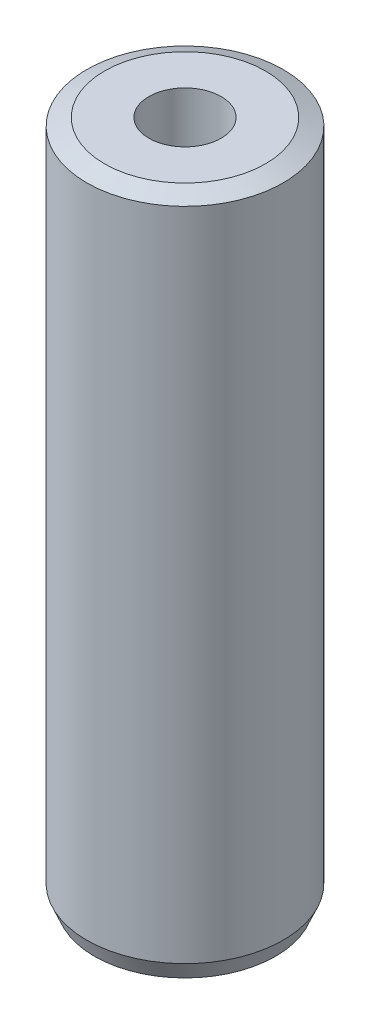
ISO-10303-21;
HEADER;
FILE_DESCRIPTION(('STEP AP214'),'2;1');
FILE_NAME('part.step','',(''),(''),'','','');
FILE_SCHEMA(('AUTOMOTIVE_DESIGN { 1 0 10303 214 1 1 1 1 }'));
ENDSEC;
DATA;
#1=APPLICATION_CONTEXT('core data for automotive mechanical design processes');
#2=APPLICATION_PROTOCOL_DEFINITION('international standard','automotive_design',2000,#1);
#3=PRODUCT_CONTEXT('',#1,'mechanical');
#4=PRODUCT('Part','Part','',(#3));
#5=PRODUCT_RELATED_PRODUCT_CATEGORY('part','',(#4));
#6=PRODUCT_DEFINITION_FORMATION('','',#4);
#7=PRODUCT_DEFINITION_CONTEXT('part definition',#1,'design');
#8=PRODUCT_DEFINITION('design','',#6,#7);
#9=PRODUCT_DEFINITION_SHAPE('','',#8);
#10=(LENGTH_UNIT() NAMED_UNIT(*) SI_UNIT(.MILLI.,.METRE.));
#11=(NAMED_UNIT(*) PLANE_ANGLE_UNIT() SI_UNIT($,.RADIAN.));
#12=(NAMED_UNIT(*) SI_UNIT($,.STERADIAN.) SOLID_ANGLE_UNIT());
#13=UNCERTAINTY_MEASURE_WITH_UNIT(LENGTH_MEASURE(1.E-05),#10,'distance_accuracy_value','');
#14=(GEOMETRIC_REPRESENTATION_CONTEXT(3) GLOBAL_UNCERTAINTY_ASSIGNED_CONTEXT((#13)) GLOBAL_UNIT_ASSIGNED_CONTEXT((#10,
#11,#12)) REPRESENTATION_CONTEXT('',''));
#15=CARTESIAN_POINT('',(0.,0.,0.));
#16=DIRECTION('',(0.,0.,1.));
#17=DIRECTION('',(1.,0.,0.));
#18=AXIS2_PLACEMENT_3D('',#15,#16,#17);
#19=CARTESIAN_POINT('',(0.,416.11274760037,0.));
#20=DIRECTION('',(0.,-1.,0.));
#21=DIRECTION('',(0.,0.,-1.));
#22=AXIS2_PLACEMENT_3D('',#19,#20,#21);
#23=CYLINDRICAL_SURFACE('',#22,60.);
#24=CARTESIAN_POINT('',(0.,411.470204463152,0.));
#25=DIRECTION('',(0.,1.,0.));
#26=DIRECTION('',(0.,0.,1.));
#27=AXIS2_PLACEMENT_3D('',#24,#25,#26);
#28=CIRCLE('',#27,60.);
#29=CARTESIAN_POINT('',(0.,411.470204463152,60.));
#30=VERTEX_POINT('',#29);
#31=EDGE_CURVE('E50',#30,#30,#28,.F.);
#32=ORIENTED_EDGE('',*,*,#31,.T.);
#33=EDGE_LOOP('',(#32));
#34=FACE_BOUND('',#33,.T.);
#35=CARTESIAN_POINT('',(0.,10.8481086715059,0.));
#36=DIRECTION('',(0.,1.,0.));
#37=DIRECTION('',(0.,0.,1.));
#38=AXIS2_PLACEMENT_3D('',#35,#36,#37);
#39=CIRCLE('',#38,60.);
#40=CARTESIAN_POINT('',(0.,10.8481086715059,60.));
#41=VERTEX_POINT('',#40);
#42=EDGE_CURVE('E51',#41,#41,#39,.T.);
#43=ORIENTED_EDGE('',*,*,#42,.T.);
#44=EDGE_LOOP('',(#43));
#45=FACE_BOUND('',#44,.T.);
#46=ADVANCED_FACE('F39',(#34,#45),#23,.T.);
#47=CARTESIAN_POINT('',(0.,416.11274760037,0.));
#48=DIRECTION('',(0.,1.,0.));
#49=DIRECTION('',(0.,0.,1.));
#50=AXIS2_PLACEMENT_3D('',#47,#48,#49);
#51=PLANE('',#50);
#52=CARTESIAN_POINT('',(0.,416.11274760037,0.));
#53=DIRECTION('',(0.,1.,0.));
#54=DIRECTION('',(0.,0.,1.));
#55=AXIS2_PLACEMENT_3D('',#52,#53,#54);
#56=CIRCLE('',#55,49.151891328494);
#57=CARTESIAN_POINT('',(0.,416.11274760037,49.151891328494));
#58=VERTEX_POINT('',#57);
#59=EDGE_CURVE('E54',#58,#58,#56,.T.);
#60=ORIENTED_EDGE('',*,*,#59,.T.);
#61=EDGE_LOOP('',(#60));
#62=FACE_BOUND('',#61,.T.);
#63=CARTESIAN_POINT('',(0.,416.11274760037,0.));
#64=DIRECTION('',(0.,1.,0.));
#65=DIRECTION('',(0.,0.,1.));
#66=AXIS2_PLACEMENT_3D('',#63,#64,#65);
#67=CIRCLE('',#66,22.0842727864073);
#68=CARTESIAN_POINT('',(0.,416.11274760037,22.0842727864073));
#69=VERTEX_POINT('',#68);
#70=EDGE_CURVE('E58',#69,#69,#67,.T.);
#71=ORIENTED_EDGE('',*,*,#70,.F.);
#72=EDGE_LOOP('',(#71));
#73=FACE_BOUND('',#72,.T.);
#74=ADVANCED_FACE('F69',(#62,#73),#51,.T.);
#75=CARTESIAN_POINT('',(0.,0.,0.));
#76=DIRECTION('',(0.,1.,0.));
#77=DIRECTION('',(0.,0.,1.));
#78=AXIS2_PLACEMENT_3D('',#75,#76,#77);
#79=PLANE('',#78);
#80=CARTESIAN_POINT('',(0.,0.,0.));
#81=DIRECTION('',(0.,1.,0.));
#82=DIRECTION('',(0.,0.,1.));
#83=AXIS2_PLACEMENT_3D('',#80,#81,#82);
#84=CIRCLE('',#83,55.3574568627817);
#85=CARTESIAN_POINT('',(0.,0.,55.3574568627817));
#86=VERTEX_POINT('',#85);
#87=EDGE_CURVE('E10',#86,#86,#84,.F.);
#88=ORIENTED_EDGE('',*,*,#87,.T.);
#89=EDGE_LOOP('',(#88));
#90=FACE_BOUND('',#89,.T.);
#91=CARTESIAN_POINT('',(0.,0.,0.));
#92=DIRECTION('',(0.,1.,0.));
#93=DIRECTION('',(0.,0.,1.));
#94=AXIS2_PLACEMENT_3D('',#91,#92,#93);
#95=CIRCLE('',#94,22.0842727864073);
#96=CARTESIAN_POINT('',(0.,0.,22.0842727864073));
#97=VERTEX_POINT('',#96);
#98=EDGE_CURVE('E63',#97,#97,#95,.T.);
#99=ORIENTED_EDGE('',*,*,#98,.T.);
#100=EDGE_LOOP('',(#99));
#101=FACE_BOUND('',#100,.T.);
#102=ADVANCED_FACE('F75',(#90,#101),#79,.F.);
#103=CARTESIAN_POINT('',(0.,416.11274760037,0.));
#104=DIRECTION('',(0.,-1.,0.));
#105=DIRECTION('',(0.,0.,-1.));
#106=AXIS2_PLACEMENT_3D('',#103,#104,#105);
#107=CYLINDRICAL_SURFACE('',#106,22.0842727864073);
#108=ORIENTED_EDGE('',*,*,#70,.T.);
#109=EDGE_LOOP('',(#108));
#110=FACE_BOUND('',#109,.T.);
#111=ORIENTED_EDGE('',*,*,#98,.F.);
#112=EDGE_LOOP('',(#111));
#113=FACE_BOUND('',#112,.T.);
#114=ADVANCED_FACE('F70',(#110,#113),#107,.F.);
#115=CARTESIAN_POINT('',(0.,416.11274760037,0.));
#116=DIRECTION('',(0.,-1.,0.));
#117=DIRECTION('',(0.,0.,-1.));
#118=AXIS2_PLACEMENT_3D('',#115,#116,#117);
#119=CONICAL_SURFACE('',#118,49.151891328494,1.1664222544761);
#120=ORIENTED_EDGE('',*,*,#31,.F.);
#121=EDGE_LOOP('',(#120));
#122=FACE_BOUND('',#121,.T.);
#123=ORIENTED_EDGE('',*,*,#59,.F.);
#124=EDGE_LOOP('',(#123));
#125=FACE_BOUND('',#124,.T.);
#126=ADVANCED_FACE('F81',(#122,#125),#119,.T.);
#127=CARTESIAN_POINT('',(0.,10.8481086715059,0.));
#128=DIRECTION('',(0.,1.,0.));
#129=DIRECTION('',(0.,0.,1.));
#130=AXIS2_PLACEMENT_3D('',#127,#128,#129);
#131=CONICAL_SURFACE('',#130,60.,0.404374072318796);
#132=ORIENTED_EDGE('',*,*,#87,.F.);
#133=EDGE_LOOP('',(#132));
#134=FACE_BOUND('',#133,.T.);
#135=ORIENTED_EDGE('',*,*,#42,.F.);
#136=EDGE_LOOP('',(#135));
#137=FACE_BOUND('',#136,.T.);
#138=ADVANCED_FACE('F45',(#134,#137),#131,.T.);
#139=CLOSED_SHELL('',(#46,#74,#102,#114,#126,#138));
#140=MANIFOLD_SOLID_BREP('B2',#139);
#141=ADVANCED_BREP_SHAPE_REPRESENTATION('',(#18,#140),#14);
#142=SHAPE_DEFINITION_REPRESENTATION(#9,#141);
ENDSEC;
END-ISO-10303-21;
